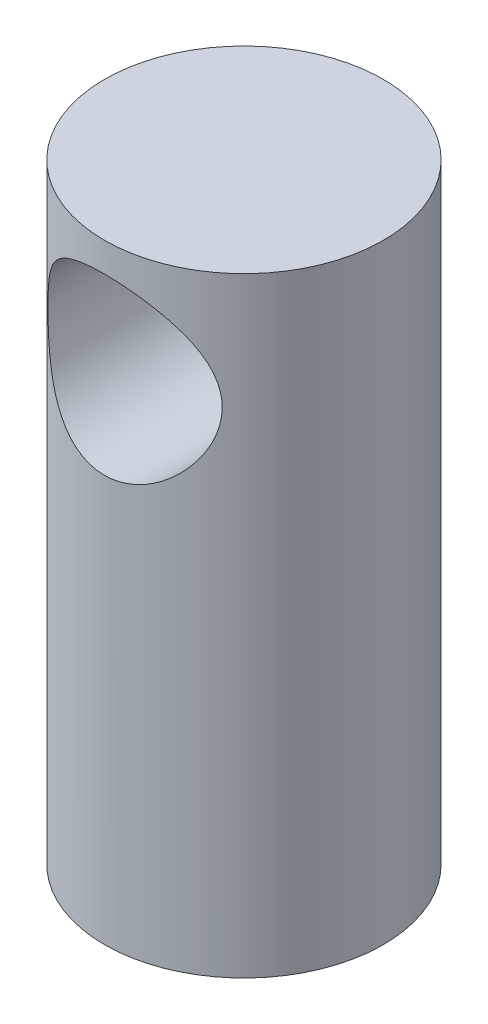
ISO-10303-21;
HEADER;
FILE_DESCRIPTION(('STEP AP214'),'2;1');
FILE_NAME('part.step','',(''),(''),'','','');
FILE_SCHEMA(('AUTOMOTIVE_DESIGN { 1 0 10303 214 1 1 1 1 }'));
ENDSEC;
DATA;
#1=APPLICATION_CONTEXT('core data for automotive mechanical design processes');
#2=APPLICATION_PROTOCOL_DEFINITION('international standard','automotive_design',2000,#1);
#3=PRODUCT_CONTEXT('',#1,'mechanical');
#4=PRODUCT('Part','Part','',(#3));
#5=PRODUCT_RELATED_PRODUCT_CATEGORY('part','',(#4));
#6=PRODUCT_DEFINITION_FORMATION('','',#4);
#7=PRODUCT_DEFINITION_CONTEXT('part definition',#1,'design');
#8=PRODUCT_DEFINITION('design','',#6,#7);
#9=PRODUCT_DEFINITION_SHAPE('','',#8);
#10=(LENGTH_UNIT() NAMED_UNIT(*) SI_UNIT(.MILLI.,.METRE.));
#11=(NAMED_UNIT(*) PLANE_ANGLE_UNIT() SI_UNIT($,.RADIAN.));
#12=(NAMED_UNIT(*) SI_UNIT($,.STERADIAN.) SOLID_ANGLE_UNIT());
#13=UNCERTAINTY_MEASURE_WITH_UNIT(LENGTH_MEASURE(1.E-05),#10,'distance_accuracy_value','');
#14=(GEOMETRIC_REPRESENTATION_CONTEXT(3) GLOBAL_UNCERTAINTY_ASSIGNED_CONTEXT((#13)) GLOBAL_UNIT_ASSIGNED_CONTEXT((#10,
#11,#12)) REPRESENTATION_CONTEXT('',''));
#15=CARTESIAN_POINT('',(0.,0.,0.));
#16=DIRECTION('',(0.,0.,1.));
#17=DIRECTION('',(1.,0.,0.));
#18=AXIS2_PLACEMENT_3D('',#15,#16,#17);
#19=CARTESIAN_POINT('',(0.,35.,0.));
#20=DIRECTION('',(0.,-1.,0.));
#21=DIRECTION('',(0.,0.,-1.));
#22=AXIS2_PLACEMENT_3D('',#19,#20,#21);
#23=CYLINDRICAL_SURFACE('',#22,8.);
#24=CARTESIAN_POINT('',(0.,33.322111541536,-8.));
#25=CARTESIAN_POINT('',(-0.127079718194145,33.322111244694,-7.99999969932038));
#26=CARTESIAN_POINT('',(-0.254165976353162,33.3172603132264,-7.99696526438072));
#27=CARTESIAN_POINT('',(-0.507365681398698,33.2979240845523,-7.98490163345175));
#28=CARTESIAN_POINT('',(-0.633478681463029,33.2834346008579,-7.97586983252039));
#29=CARTESIAN_POINT('',(-0.883879235580957,33.2449993762978,-7.95201844653618));
#30=CARTESIAN_POINT('',(-1.00816396386935,33.221040325904,-7.93719071559646));
#31=CARTESIAN_POINT('',(-1.25388007858571,33.1639813258615,-7.90210083284868));
#32=CARTESIAN_POINT('',(-1.3753102342372,33.1308775090448,-7.88183638204784));
#33=CARTESIAN_POINT('',(-1.61383677448202,33.0561439402366,-7.83646507337636));
#34=CARTESIAN_POINT('',(-1.73095311667823,33.0145614765876,-7.81138511664483));
#35=CARTESIAN_POINT('',(-1.96091650164603,32.9232130662876,-7.75685494898749));
#36=CARTESIAN_POINT('',(-2.07376186971093,32.873443949607,-7.7274030455926));
#37=CARTESIAN_POINT('',(-2.40491190911409,32.7126148995303,-7.63340708241437));
#38=CARTESIAN_POINT('',(-2.61609848167961,32.5899480912948,-7.5631697348111));
#39=CARTESIAN_POINT('',(-3.03193014433839,32.3065575884985,-7.40680295707224));
#40=CARTESIAN_POINT('',(-3.23470598963289,32.143577004981,-7.31985233528323));
#41=CARTESIAN_POINT('',(-3.61195776992338,31.7892121498396,-7.1412401292643));
#42=CARTESIAN_POINT('',(-3.78639500697958,31.5977897105571,-7.04957232454122));
#43=CARTESIAN_POINT('',(-4.03551059577151,31.2778257917459,-6.90836217121019));
#44=CARTESIAN_POINT('',(-4.12074022592499,31.1578244105636,-6.85772204075824));
#45=CARTESIAN_POINT('',(-4.28074637131475,30.9099605051913,-6.75899646823101));
#46=CARTESIAN_POINT('',(-4.35552092872511,30.7820965150795,-6.71091150568103));
#47=CARTESIAN_POINT('',(-4.49385262588457,30.51922735386,-6.61907677956953));
#48=CARTESIAN_POINT('',(-4.55742717693475,30.3842336987737,-6.57532033426424));
#49=CARTESIAN_POINT('',(-4.67278116226384,30.1074890938389,-6.49385156056842));
#50=CARTESIAN_POINT('',(-4.72456056034896,29.9657381232569,-6.45613925072462));
#51=CARTESIAN_POINT('',(-4.80367778250346,29.7139779586155,-6.39737739560479));
#52=CARTESIAN_POINT('',(-4.83387146386473,29.6052754871241,-6.37454329188128));
#53=CARTESIAN_POINT('',(-4.8869893698177,29.3851923946622,-6.33391313113232));
#54=CARTESIAN_POINT('',(-4.90991524122178,29.2738123865568,-6.31611593289309));
#55=CARTESIAN_POINT('',(-4.94817199977536,29.0491352031964,-6.28619004435451));
#56=CARTESIAN_POINT('',(-4.96351189515875,28.9358404678678,-6.27405463174267));
#57=CARTESIAN_POINT('',(-4.98640391146144,28.7079702507212,-6.25587655110007));
#58=CARTESIAN_POINT('',(-4.99395573327638,28.5933947198845,-6.249834117073));
#59=CARTESIAN_POINT('',(-5.00115324292108,28.3635528877206,-6.24407626191297));
#60=CARTESIAN_POINT('',(-5.00077951510321,28.2482855817406,-6.24437637846302));
#61=CARTESIAN_POINT('',(-4.99208386707443,28.0182055480199,-6.2513301416873));
#62=CARTESIAN_POINT('',(-4.98375903270659,27.9033930024461,-6.25798611784493));
#63=CARTESIAN_POINT('',(-4.95928874246478,27.6750904595571,-6.27739584443856));
#64=CARTESIAN_POINT('',(-4.94314081984502,27.5616008909644,-6.29015151819107));
#65=CARTESIAN_POINT('',(-4.90327193771259,27.3367253383574,-6.32127805222651));
#66=CARTESIAN_POINT('',(-4.87954784440757,27.2253402450632,-6.33965123599107));
#67=CARTESIAN_POINT('',(-4.79874186577055,26.9004915572456,-6.40129934062341));
#68=CARTESIAN_POINT('',(-4.73140686716691,26.6908190636873,-6.4516270932374));
#69=CARTESIAN_POINT('',(-4.57160139234777,26.2854294530762,-6.565824165778));
#70=CARTESIAN_POINT('',(-4.47912202607653,26.0897173028025,-6.62969827340046));
#71=CARTESIAN_POINT('',(-4.25180409904384,25.6787968882868,-6.77818972806845));
#72=CARTESIAN_POINT('',(-4.1122797851601,25.4667763392551,-6.86445305269834));
#73=CARTESIAN_POINT('',(-3.80349790123425,25.0667623577958,-7.04023909017201));
#74=CARTESIAN_POINT('',(-3.63420977102789,24.878793967134,-7.12976507734762));
#75=CARTESIAN_POINT('',(-3.34462792787133,24.6025429934717,-7.26825220927602));
#76=CARTESIAN_POINT('',(-3.23332743959703,24.5053687403321,-7.31856628212432));
#77=CARTESIAN_POINT('',(-3.00184758289934,24.3207604287514,-7.4165140520612));
#78=CARTESIAN_POINT('',(-2.88167150233174,24.2333227933003,-7.464148730294));
#79=CARTESIAN_POINT('',(-2.63291547069674,24.0688783214509,-7.55548277586875));
#80=CARTESIAN_POINT('',(-2.50433330649265,23.9918742485087,-7.59918109959603));
#81=CARTESIAN_POINT('',(-2.23953943503378,23.8491862534052,-7.68138405457136));
#82=CARTESIAN_POINT('',(-2.1033325054106,23.7834953453944,-7.71989188771748));
#83=CARTESIAN_POINT('',(-1.83158498937008,23.6674426767829,-7.78870197133489));
#84=CARTESIAN_POINT('',(-1.69639792018988,23.6164492437615,-7.81933279806533));
#85=CARTESIAN_POINT('',(-1.42097512774062,23.526090551917,-7.87404113157595));
#86=CARTESIAN_POINT('',(-1.28074233969551,23.4867186514302,-7.89812238079521));
#87=CARTESIAN_POINT('',(-0.996484502868516,23.4202441431294,-7.93899345279391));
#88=CARTESIAN_POINT('',(-0.852462989802583,23.3931304974228,-7.95578983464414));
#89=CARTESIAN_POINT('',(-0.56191536170766,23.351621191563,-7.98157299247508));
#90=CARTESIAN_POINT('',(-0.415389678880737,23.3372233589012,-7.99056110250213));
#91=CARTESIAN_POINT('',(-0.143238039189034,23.322591377443,-7.99969867025939));
#92=CARTESIAN_POINT('',(-0.0177414078568075,23.320570677447,-8.00096292697891));
#93=CARTESIAN_POINT('',(0.232966367766403,23.3259687630402,-7.99758945182604));
#94=CARTESIAN_POINT('',(0.358177530272762,23.3333869284435,-7.9929521077216));
#95=CARTESIAN_POINT('',(0.607327834496615,23.3575553190628,-7.97789005521255));
#96=CARTESIAN_POINT('',(0.731267089300075,23.3743047071845,-7.96746586594014));
#97=CARTESIAN_POINT('',(0.976969695221645,23.4169022342133,-7.94108300214141));
#98=CARTESIAN_POINT('',(1.09873300792335,23.442750533596,-7.92512423000295));
#99=CARTESIAN_POINT('',(1.33450834578853,23.5020209887273,-7.88877344649023));
#100=CARTESIAN_POINT('',(1.44863666980924,23.5351041856506,-7.86858112898481));
#101=CARTESIAN_POINT('',(1.67350231741758,23.6090005741784,-7.82384532964923));
#102=CARTESIAN_POINT('',(1.78423846943478,23.6498164022376,-7.7993003639589));
#103=CARTESIAN_POINT('',(2.11043845304159,23.7832613184687,-7.7198451952159));
#104=CARTESIAN_POINT('',(2.32007565393525,23.8869342534154,-7.65908557136377));
#105=CARTESIAN_POINT('',(2.74037159603305,24.1321836051639,-7.51959499245697));
#106=CARTESIAN_POINT('',(2.94899750641245,24.2765296781205,-7.43966908727208));
#107=CARTESIAN_POINT('',(3.340560915065,24.5932831382032,-7.27228030716763));
#108=CARTESIAN_POINT('',(3.52346945040511,24.7657216989204,-7.1848091107345));
#109=CARTESIAN_POINT('',(3.88590040481164,25.1626565084559,-6.99623419569616));
#110=CARTESIAN_POINT('',(4.06107692783137,25.3910759328792,-6.89499476958427));
#111=CARTESIAN_POINT('',(4.37121122716533,25.8775991259583,-6.70267107654715));
#112=CARTESIAN_POINT('',(4.50619684735977,26.135682171325,-6.61157980658315));
#113=CARTESIAN_POINT('',(4.70739703071134,26.6209254992279,-6.46933988973206));
#114=CARTESIAN_POINT('',(4.78209607779641,26.843227269638,-6.41382106492075));
#115=CARTESIAN_POINT('',(4.87056932795047,27.1856770298554,-6.34656596743547));
#116=CARTESIAN_POINT('',(4.89612834571373,27.3013016648792,-6.32682054908637));
#117=CARTESIAN_POINT('',(4.93906627660446,27.534898531634,-6.29335959003546));
#118=CARTESIAN_POINT('',(4.95644870968554,27.6528697303494,-6.27964145480505));
#119=CARTESIAN_POINT('',(4.98283345322303,27.8910485650049,-6.25872646567769));
#120=CARTESIAN_POINT('',(4.99178464992502,28.0112653923416,-6.25156939465669));
#121=CARTESIAN_POINT('',(5.00096567028373,28.2522464642379,-6.24422754057757));
#122=CARTESIAN_POINT('',(5.00119553239925,28.3730107063812,-6.24404272677361));
#123=CARTESIAN_POINT('',(4.99292458618068,28.6140870673471,-6.25065867247708));
#124=CARTESIAN_POINT('',(4.98442112542227,28.7343990376673,-6.2574615542391));
#125=CARTESIAN_POINT('',(4.95884706925013,28.9735052045182,-6.27774556876195));
#126=CARTESIAN_POINT('',(4.94177659470706,29.0922994224385,-6.2912266073017));
#127=CARTESIAN_POINT('',(4.88153513763474,29.4260829315141,-6.33822773980263));
#128=CARTESIAN_POINT('',(4.82847742875036,29.6383493015611,-6.37907576446225));
#129=CARTESIAN_POINT('',(4.69670428935884,30.05069124269,-6.47669777004122));
#130=CARTESIAN_POINT('',(4.61797815957074,30.2507616888376,-6.53347839071251));
#131=CARTESIAN_POINT('',(4.42410573147435,30.664487104609,-6.66655793133305));
#132=CARTESIAN_POINT('',(4.30533683658204,30.8759154975045,-6.74449249142917));
#133=CARTESIAN_POINT('',(4.04000963034607,31.2778622462169,-6.90670498235136));
#134=CARTESIAN_POINT('',(3.89342885237777,31.4683634991378,-6.99098800808705));
#135=CARTESIAN_POINT('',(3.54264024371938,31.8621955107432,-7.17608994782601));
#136=CARTESIAN_POINT('',(3.33276887019885,32.0605894316265,-7.27687640364452));
#137=CARTESIAN_POINT('',(2.99268031590093,32.3302117716962,-7.42018359046303));
#138=CARTESIAN_POINT('',(2.87498419390475,32.4154898597895,-7.46667962522411));
#139=CARTESIAN_POINT('',(2.63162062416604,32.5760264015615,-7.55588019054725));
#140=CARTESIAN_POINT('',(2.50595739502895,32.6512900935394,-7.59858669939735));
#141=CARTESIAN_POINT('',(2.24695585117552,32.7912178120623,-7.67916888890582));
#142=CARTESIAN_POINT('',(2.11359966396132,32.8558556927622,-7.71703260409719));
#143=CARTESIAN_POINT('',(1.8403912735063,32.9734616023325,-7.78670745066037));
#144=CARTESIAN_POINT('',(1.70054287903652,33.0264363713838,-7.81852207637899));
#145=CARTESIAN_POINT('',(1.41574969186899,33.1198244288489,-7.87506644788239));
#146=CARTESIAN_POINT('',(1.27081981592251,33.1602715342433,-7.89981525263675));
#147=CARTESIAN_POINT('',(0.976912453464878,33.2280625743948,-7.9415135957936));
#148=CARTESIAN_POINT('',(0.827938038321409,33.2554161734712,-7.95846888622183));
#149=CARTESIAN_POINT('',(0.565708034628106,33.2912930425679,-7.98076605772891));
#150=CARTESIAN_POINT('',(0.453012043961126,33.3028370455377,-7.98796542217807));
#151=CARTESIAN_POINT('',(0.226879136348951,33.3182466651417,-7.99758267549434));
#152=CARTESIAN_POINT('',(0.113442173980088,33.3221118065224,-8.00000026841223));
#153=CARTESIAN_POINT('',(0.,33.322111541536,-8.));
#154=B_SPLINE_CURVE_WITH_KNOTS('',3,(#24,#25,#26,#27,#28,#29,#30,#31,#32,#33,#34,#35,#36,#37,
#38,#39,#40,#41,#42,#43,#44,#45,#46,#47,#48,#49,#50,#51,#52,#53,#54,#55,#56,#57,#58,#59,#60,#61,
#62,#63,#64,#65,#66,#67,#68,#69,#70,#71,#72,#73,#74,#75,#76,#77,#78,#79,#80,#81,#82,#83,#84,#85,
#86,#87,#88,#89,#90,#91,#92,#93,#94,#95,#96,#97,#98,#99,#100,#101,#102,#103,#104,#105,#106,#107,
#108,#109,#110,#111,#112,#113,#114,#115,#116,#117,#118,#119,#120,#121,#122,#123,#124,#125,#126,
#127,#128,#129,#130,#131,#132,#133,#134,#135,#136,#137,#138,#139,#140,#141,#142,#143,#144,#145,
#146,#147,#148,#149,#150,#151,#152,#153),.UNSPECIFIED.,.T.,.F.,(4,2,2,2,2,2,2,2,2,2,2,2,2,2,2,2,
2,2,2,2,2,2,2,2,2,2,2,2,2,2,2,2,2,2,2,2,2,2,2,2,2,2,2,2,2,2,2,2,2,2,2,2,2,2,2,2,2,2,2,2,2,2,2,2,
4),(0.,0.38112281387823,0.762411275945245,1.14423755771084,1.52622555522555,1.90613865065076,
2.2861992035346,3.04547146930923,3.86537873527686,4.68639638614618,5.15288943324734,
5.61946971957747,6.08531814323784,6.55116799634915,6.89615022205286,7.24105422230075,
7.58554766475416,7.93005433713581,8.27540506342305,8.62088241265912,8.96646876744119,
9.31219825544433,9.98712845371039,10.6622975916544,11.463592889512,12.2657157783383,
12.7334704505957,13.2010527095967,13.6687585723722,14.1361745843372,14.5786070973028,
15.0207862699487,15.4625664873667,15.9042712116065,16.280349331717,16.6564027426817,
17.0324224237136,17.4084487368524,17.7696430642803,18.1309607639224,18.8530325398091,
19.6479898222925,20.4438353357779,21.355208937219,22.2659496705469,22.9857781952855,
23.3455439181714,23.705154622762,24.0669316687914,24.4287071194786,24.7905924786019,
25.1524727320855,25.8172983911075,26.482401522191,27.2437925511324,28.0058012758041,
28.9187931910578,29.3761295657643,29.8332257699805,30.2914303932663,30.7493695182481,
31.2060614935589,31.6624158626754,32.0026174741983,32.3428401405226),.UNSPECIFIED.);
#155=CARTESIAN_POINT('',(0.,33.322111541536,-8.));
#156=VERTEX_POINT('',#155);
#157=EDGE_CURVE('E10',#156,#156,#154,.T.);
#158=ORIENTED_EDGE('',*,*,#157,.T.);
#159=EDGE_LOOP('',(#158));
#160=FACE_BOUND('',#159,.T.);
#161=CARTESIAN_POINT('',(5.,28.322111541536,6.2449979983984));
#162=CARTESIAN_POINT('',(4.99999874728376,28.1978015444511,6.24499999083318));
#163=CARTESIAN_POINT('',(4.99535477639502,28.0734676296138,6.24872594235153));
#164=CARTESIAN_POINT('',(4.97686385741702,27.8258691963182,6.26346233698878));
#165=CARTESIAN_POINT('',(4.96301148892208,27.7026053510617,6.27447707053878));
#166=CARTESIAN_POINT('',(4.92631685582622,27.4579786474275,6.30332817855701));
#167=CARTESIAN_POINT('',(4.90345645667282,27.3366201404652,6.32117831167981));
#168=CARTESIAN_POINT('',(4.84912073775945,27.0968930815087,6.36295500797281));
#169=CARTESIAN_POINT('',(4.81764111134032,26.978526056611,6.38688460836052));
#170=CARTESIAN_POINT('',(4.7115563432738,26.631128689766,6.46598710467671));
#171=CARTESIAN_POINT('',(4.6249307188155,26.407389950194,6.52878844336903));
#172=CARTESIAN_POINT('',(4.42286683667303,25.9780352504837,6.66732308206754));
#173=CARTESIAN_POINT('',(4.30742779304936,25.7724197848983,6.74305673480881));
#174=CARTESIAN_POINT('',(4.03296948836377,25.3546701285193,6.91118002626909));
#175=CARTESIAN_POINT('',(3.87018134056582,25.1453620120303,7.00444112628932));
#176=CARTESIAN_POINT('',(3.51319765959103,24.7545512850056,7.19012524520994));
#177=CARTESIAN_POINT('',(3.31897506071619,24.5730729010428,7.28254746874407));
#178=CARTESIAN_POINT('',(2.99356128179165,24.3145052800436,7.41988971846401));
#179=CARTESIAN_POINT('',(2.87212880091628,24.226563248119,7.46785190700924));
#180=CARTESIAN_POINT('',(2.62078661715025,24.0613520243632,7.55971876275306));
#181=CARTESIAN_POINT('',(2.49088050482953,23.9840783546843,7.60362512973126));
#182=CARTESIAN_POINT('',(2.22333771815378,23.8410661732212,7.68611478127736));
#183=CARTESIAN_POINT('',(2.08570487145724,23.775322015378,7.72470066932016));
#184=CARTESIAN_POINT('',(1.80358193532004,23.6562224051352,7.79539753077303));
#185=CARTESIAN_POINT('',(1.65909309867121,23.6028646997844,7.82750968154027));
#186=CARTESIAN_POINT('',(1.37943032429723,23.5141541228439,7.88132879110577));
#187=CARTESIAN_POINT('',(1.2448010642007,23.4775228995685,7.90376135583819));
#188=CARTESIAN_POINT('',(0.972050692903703,23.4155172660417,7.94191844310852));
#189=CARTESIAN_POINT('',(0.833930165626442,23.3901409863689,7.95764407963578));
#190=CARTESIAN_POINT('',(0.555534462309623,23.3510831532944,7.98191012055643));
#191=CARTESIAN_POINT('',(0.415261158337189,23.3373919666988,7.9904564434862));
#192=CARTESIAN_POINT('',(0.133810084943772,23.3219164561832,8.00011955525847));
#193=CARTESIAN_POINT('',(-0.0073675784982063,23.3201307617526,8.00123719925945));
#194=CARTESIAN_POINT('',(-0.270239609899373,23.3279284731159,7.99636544353032));
#195=CARTESIAN_POINT('',(-0.391999310072931,23.3360143136945,7.99131217584322));
#196=CARTESIAN_POINT('',(-0.634293592306137,23.3610120346437,7.97573898833036));
#197=CARTESIAN_POINT('',(-0.754827796543426,23.3779265575358,7.96521743178982));
#198=CARTESIAN_POINT('',(-0.993750416290298,23.4203595848621,7.93894787928476));
#199=CARTESIAN_POINT('',(-1.11213954368103,23.4458751776537,7.92320165200919));
#200=CARTESIAN_POINT('',(-1.34607315554106,23.5051961814941,7.88683283084566));
#201=CARTESIAN_POINT('',(-1.46161652141072,23.539004796858,7.86620835217572));
#202=CARTESIAN_POINT('',(-1.80341623892686,23.6524974736631,7.79753837345255));
#203=CARTESIAN_POINT('',(-2.0244725048806,23.7441814686232,7.74273886956257));
#204=CARTESIAN_POINT('',(-2.44811588786114,23.9559959338193,7.6194209119633));
#205=CARTESIAN_POINT('',(-2.6506987826293,24.0761328847816,7.55089933332867));
#206=CARTESIAN_POINT('',(-3.05883635403528,24.3582148613008,7.39573414184525));
#207=CARTESIAN_POINT('',(-3.2616234577039,24.5235022060705,7.30789649394851));
#208=CARTESIAN_POINT('',(-3.63842034253163,24.8826689448855,7.12780216070677));
#209=CARTESIAN_POINT('',(-3.81238750882611,25.0765898915019,7.0355391870356));
#210=CARTESIAN_POINT('',(-4.05999923159469,25.4001134811783,6.89398778931582));
#211=CARTESIAN_POINT('',(-4.14440430037547,25.5210800089892,6.84343529038729));
#212=CARTESIAN_POINT('',(-4.30267035241461,25.7708604014491,6.7450499014227));
#213=CARTESIAN_POINT('',(-4.37652935467605,25.8996757339687,6.69721752335299));
#214=CARTESIAN_POINT('',(-4.51291782494085,26.164402275854,6.60608014442446));
#215=CARTESIAN_POINT('',(-4.57546644816391,26.3003009761749,6.56276754252838));
#216=CARTESIAN_POINT('',(-4.6886516739402,26.5788038590917,6.48238923774268));
#217=CARTESIAN_POINT('',(-4.7392883475702,26.7214080016712,6.44532349757936));
#218=CARTESIAN_POINT('',(-4.81614194168603,26.9740273860197,6.3879911088914));
#219=CARTESIAN_POINT('',(-4.84527833481626,27.0827414362042,6.36587062744548));
#220=CARTESIAN_POINT('',(-4.89628944573215,27.3027525395237,6.3267200135842));
#221=CARTESIAN_POINT('',(-4.91816581196151,27.414049000154,6.30968872571675));
#222=CARTESIAN_POINT('',(-4.95434333722363,27.638457048388,6.2813224765214));
#223=CARTESIAN_POINT('',(-4.96865318123363,27.7515664007398,6.26998098512218));
#224=CARTESIAN_POINT('',(-4.98951663397229,27.9789532668689,6.25339132178237));
#225=CARTESIAN_POINT('',(-4.99606992689043,28.0932308280191,6.24814339794355));
#226=CARTESIAN_POINT('',(-5.00131530513999,28.3223252978635,6.24394563972606));
#227=CARTESIAN_POINT('',(-4.99999077198393,28.4371428358214,6.2450091194138));
#228=CARTESIAN_POINT('',(-4.98946310366482,28.6662221313759,6.25342323341975));
#229=CARTESIAN_POINT('',(-4.98025707456075,28.7804836693193,6.26077617711313));
#230=CARTESIAN_POINT('',(-4.95410620951326,29.0076039771779,6.28148941326477));
#231=CARTESIAN_POINT('',(-4.9371587646522,29.1204622610039,6.29485173090555));
#232=CARTESIAN_POINT('',(-4.8957794498311,29.3440152234831,6.32708655414445));
#233=CARTESIAN_POINT('',(-4.87134448334739,29.4547089867955,6.3459613393153));
#234=CARTESIAN_POINT('',(-4.78821642821575,29.7788526846961,6.40919739263554));
#235=CARTESIAN_POINT('',(-4.71921780239627,29.9883892686384,6.46057720915497));
#236=CARTESIAN_POINT('',(-4.55609149726002,30.3932978598403,6.57662484324881));
#237=CARTESIAN_POINT('',(-4.46195489902188,30.5886648083859,6.6412973751829));
#238=CARTESIAN_POINT('',(-4.2306237748224,30.9993172963144,6.79148506979737));
#239=CARTESIAN_POINT('',(-4.08864375810928,31.2113134934891,6.87862419429458));
#240=CARTESIAN_POINT('',(-3.77473221644169,31.6108799943955,7.05576916354208));
#241=CARTESIAN_POINT('',(-3.6027696158765,31.7984245991491,7.14577790263999));
#242=CARTESIAN_POINT('',(-3.30924585333198,32.07320591539,7.28444679190234));
#243=CARTESIAN_POINT('',(-3.196775346496,32.16953462553,7.33462309019929));
#244=CARTESIAN_POINT('',(-2.9629769679861,32.3523436565185,7.43214539316411));
#245=CARTESIAN_POINT('',(-2.84165245789287,32.438827683481,7.47949245970999));
#246=CARTESIAN_POINT('',(-2.59064393379974,32.6012369842979,7.57009743381039));
#247=CARTESIAN_POINT('',(-2.46095822963469,32.6771601134745,7.61335451021155));
#248=CARTESIAN_POINT('',(-2.19402109584823,32.8175526452256,7.69452475176041));
#249=CARTESIAN_POINT('',(-2.05677447863485,32.8820292254737,7.73244126265916));
#250=CARTESIAN_POINT('',(-1.78389488579444,32.9952507652795,7.79976180045409));
#251=CARTESIAN_POINT('',(-1.64864631402093,33.0447004776537,7.82953658856128));
#252=CARTESIAN_POINT('',(-1.37327166975238,33.1319940432734,7.88249738910155));
#253=CARTESIAN_POINT('',(-1.23314847311441,33.1698446145145,7.90568721484267));
#254=CARTESIAN_POINT('',(-0.949284871547732,33.2333223004152,7.94476970960063));
#255=CARTESIAN_POINT('',(-0.80554773763034,33.2589600774405,7.96066874338032));
#256=CARTESIAN_POINT('',(-0.515747890604373,33.2975875496586,7.98468098207153));
#257=CARTESIAN_POINT('',(-0.369685566273108,33.3105793371775,7.99279547496113));
#258=CARTESIAN_POINT('',(-0.09845423984636,33.3227033620131,8.00036899836203));
#259=CARTESIAN_POINT('',(0.026609190110776,33.3236015386345,8.000930859058));
#260=CARTESIAN_POINT('',(0.27638442654849,33.3160302338021,7.99619997327325));
#261=CARTESIAN_POINT('',(0.401096114033579,33.3075578925831,7.99090543949389));
#262=CARTESIAN_POINT('',(0.649105048465694,33.2813661674335,7.97459103015405));
#263=CARTESIAN_POINT('',(0.772402893113259,33.2636508502307,7.96357367253312));
#264=CARTESIAN_POINT('',(1.01678782002795,33.2192101769753,7.93607401526799));
#265=CARTESIAN_POINT('',(1.1378740307512,33.1924813463944,7.91958960822669));
#266=CARTESIAN_POINT('',(1.37276960676338,33.1314466676534,7.88220417715129));
#267=CARTESIAN_POINT('',(1.48668509743699,33.0974405645002,7.86147899328625));
#268=CARTESIAN_POINT('',(1.71105112688165,33.0217222572059,7.81571728202851));
#269=CARTESIAN_POINT('',(1.82150046585625,32.9800074183921,7.79067928081094));
#270=CARTESIAN_POINT('',(2.146743229529,32.8439085493888,7.70981708144695));
#271=CARTESIAN_POINT('',(2.35561190892489,32.7385225581382,7.64821482975006));
#272=CARTESIAN_POINT('',(2.77466231937411,32.4894575755672,7.50700801995937));
#273=CARTESIAN_POINT('',(2.98273013480177,32.3429393367138,7.42619858107809));
#274=CARTESIAN_POINT('',(3.37285679634254,32.0218093046088,7.2573471375721));
#275=CARTESIAN_POINT('',(3.55488585185796,31.847165811427,7.16929702745266));
#276=CARTESIAN_POINT('',(3.91489797533941,31.4456402328692,6.98001614835192));
#277=CARTESIAN_POINT('',(4.08851588919804,31.2148569270616,6.87871489286988));
#278=CARTESIAN_POINT('',(4.39509030747829,30.7235540994902,6.68699282488336));
#279=CARTESIAN_POINT('',(4.528069300442,30.4630511338397,6.59656601160477));
#280=CARTESIAN_POINT('',(4.72397005512007,29.976439144279,6.45719150743099));
#281=CARTESIAN_POINT('',(4.79586701428079,29.755363401191,6.40349524541685));
#282=CARTESIAN_POINT('',(4.8804160395343,29.4153551684406,6.33898756748728));
#283=CARTESIAN_POINT('',(4.90470355408434,29.300739461609,6.32016868842665));
#284=CARTESIAN_POINT('',(4.94524770814465,29.0693052105061,6.28849738412123));
#285=CARTESIAN_POINT('',(4.9615084801139,28.9524878319648,6.27564188891545));
#286=CARTESIAN_POINT('',(4.9823903295282,28.7500066285151,6.25906589814134));
#287=CARTESIAN_POINT('',(4.98898701036639,28.6646648639787,6.25380210027526));
#288=CARTESIAN_POINT('',(4.99779282932784,28.4935897686729,6.24676702410078));
#289=CARTESIAN_POINT('',(5.00000086408101,28.4078563448635,6.24499662408472));
#290=CARTESIAN_POINT('',(5.,28.322111541536,6.2449979983984));
#291=B_SPLINE_CURVE_WITH_KNOTS('',3,(#161,#162,#163,#164,#165,#166,#167,#168,#169,#170,#171,
#172,#173,#174,#175,#176,#177,#178,#179,#180,#181,#182,#183,#184,#185,#186,#187,#188,#189,#190,
#191,#192,#193,#194,#195,#196,#197,#198,#199,#200,#201,#202,#203,#204,#205,#206,#207,#208,#209,
#210,#211,#212,#213,#214,#215,#216,#217,#218,#219,#220,#221,#222,#223,#224,#225,#226,#227,#228,
#229,#230,#231,#232,#233,#234,#235,#236,#237,#238,#239,#240,#241,#242,#243,#244,#245,#246,#247,
#248,#249,#250,#251,#252,#253,#254,#255,#256,#257,#258,#259,#260,#261,#262,#263,#264,#265,#266,
#267,#268,#269,#270,#271,#272,#273,#274,#275,#276,#277,#278,#279,#280,#281,#282,#283,#284,#285,
#286,#287,#288,#289,#290),.UNSPECIFIED.,.T.,.F.,(4,2,2,2,2,2,2,2,2,2,2,2,2,2,2,2,2,2,2,2,2,2,2,
2,2,2,2,2,2,2,2,2,2,2,2,2,2,2,2,2,2,2,2,2,2,2,2,2,2,2,2,2,2,2,2,2,2,2,2,2,2,2,2,2,4),(0.,
0.372830631717395,0.745880919988996,1.11968608457865,1.49367836553752,2.23437397247079,
2.97508978546025,3.81517657771247,4.65599058786116,5.12769727095079,5.59920535801265,
6.07048189652379,6.54167264805615,6.9650003716167,7.38825775501684,7.8111658669397,
8.2340252946041,8.59998197802636,8.96604825916241,9.33199074341863,9.69807484639391,
10.4313641163756,11.1648205684642,11.9895533165928,12.8154948839412,13.2827866246025,
13.7501660272479,14.2167463086997,14.6833238060682,15.0271003394338,15.3707987622619,
15.7141018213498,16.0574188576537,16.4014603870609,16.7456282964257,17.0899122787371,
17.4343388350078,18.1111129623981,18.7881275281776,19.5940378131019,20.4007884080993,
20.8693475683427,21.337729748067,21.8062069071061,22.2743892571628,22.7148894158781,
23.1551339612148,23.5949934439159,24.0347801378503,24.409509228706,24.7843527137741,
25.1590314139736,25.5338547106938,25.8954875601863,26.2572442370256,26.9801965139639,
27.7781872367985,28.5770837508034,29.4911341692987,30.4046778558642,31.1173375632652,
31.472952845656,31.8283848529182,32.0854860972178,32.3426519723746),.UNSPECIFIED.);
#292=CARTESIAN_POINT('',(5.,28.322111541536,6.2449979983984));
#293=VERTEX_POINT('',#292);
#294=EDGE_CURVE('E53',#293,#293,#291,.T.);
#295=ORIENTED_EDGE('',*,*,#294,.T.);
#296=EDGE_LOOP('',(#295));
#297=FACE_BOUND('',#296,.T.);
#298=CARTESIAN_POINT('',(0.,35.,0.));
#299=DIRECTION('',(0.,1.,0.));
#300=DIRECTION('',(0.,0.,1.));
#301=AXIS2_PLACEMENT_3D('',#298,#299,#300);
#302=CIRCLE('',#301,8.);
#303=CARTESIAN_POINT('',(0.,35.,8.));
#304=VERTEX_POINT('',#303);
#305=EDGE_CURVE('E58',#304,#304,#302,.T.);
#306=ORIENTED_EDGE('',*,*,#305,.F.);
#307=EDGE_LOOP('',(#306));
#308=FACE_BOUND('',#307,.T.);
#309=CARTESIAN_POINT('',(0.,0.,0.));
#310=DIRECTION('',(0.,1.,0.));
#311=DIRECTION('',(0.,0.,1.));
#312=AXIS2_PLACEMENT_3D('',#309,#310,#311);
#313=CIRCLE('',#312,8.);
#314=CARTESIAN_POINT('',(0.,0.,8.));
#315=VERTEX_POINT('',#314);
#316=EDGE_CURVE('E63',#315,#315,#313,.T.);
#317=ORIENTED_EDGE('',*,*,#316,.T.);
#318=EDGE_LOOP('',(#317));
#319=FACE_BOUND('',#318,.T.);
#320=ADVANCED_FACE('F41',(#160,#297,#308,#319),#23,.T.);
#321=CARTESIAN_POINT('',(0.,35.,0.));
#322=DIRECTION('',(0.,1.,0.));
#323=DIRECTION('',(0.,0.,1.));
#324=AXIS2_PLACEMENT_3D('',#321,#322,#323);
#325=PLANE('',#324);
#326=ORIENTED_EDGE('',*,*,#305,.T.);
#327=EDGE_LOOP('',(#326));
#328=FACE_BOUND('',#327,.T.);
#329=ADVANCED_FACE('F75',(#328),#325,.T.);
#330=CARTESIAN_POINT('',(0.,0.,0.));
#331=DIRECTION('',(0.,1.,0.));
#332=DIRECTION('',(0.,0.,1.));
#333=AXIS2_PLACEMENT_3D('',#330,#331,#332);
#334=PLANE('',#333);
#335=ORIENTED_EDGE('',*,*,#316,.F.);
#336=EDGE_LOOP('',(#335));
#337=FACE_BOUND('',#336,.T.);
#338=ADVANCED_FACE('F73',(#337),#334,.F.);
#339=CARTESIAN_POINT('',(0.,28.322111541536,-8.));
#340=DIRECTION('',(0.,0.,1.));
#341=DIRECTION('',(1.,0.,0.));
#342=AXIS2_PLACEMENT_3D('',#339,#340,#341);
#343=CYLINDRICAL_SURFACE('',#342,5.);
#344=ORIENTED_EDGE('',*,*,#294,.F.);
#345=EDGE_LOOP('',(#344));
#346=FACE_BOUND('',#345,.T.);
#347=ORIENTED_EDGE('',*,*,#157,.F.);
#348=EDGE_LOOP('',(#347));
#349=FACE_BOUND('',#348,.T.);
#350=ADVANCED_FACE('F69',(#346,#349),#343,.F.);
#351=CLOSED_SHELL('',(#320,#329,#338,#350));
#352=MANIFOLD_SOLID_BREP('B2',#351);
#353=ADVANCED_BREP_SHAPE_REPRESENTATION('',(#18,#352),#14);
#354=SHAPE_DEFINITION_REPRESENTATION(#9,#353);
ENDSEC;
END-ISO-10303-21;
